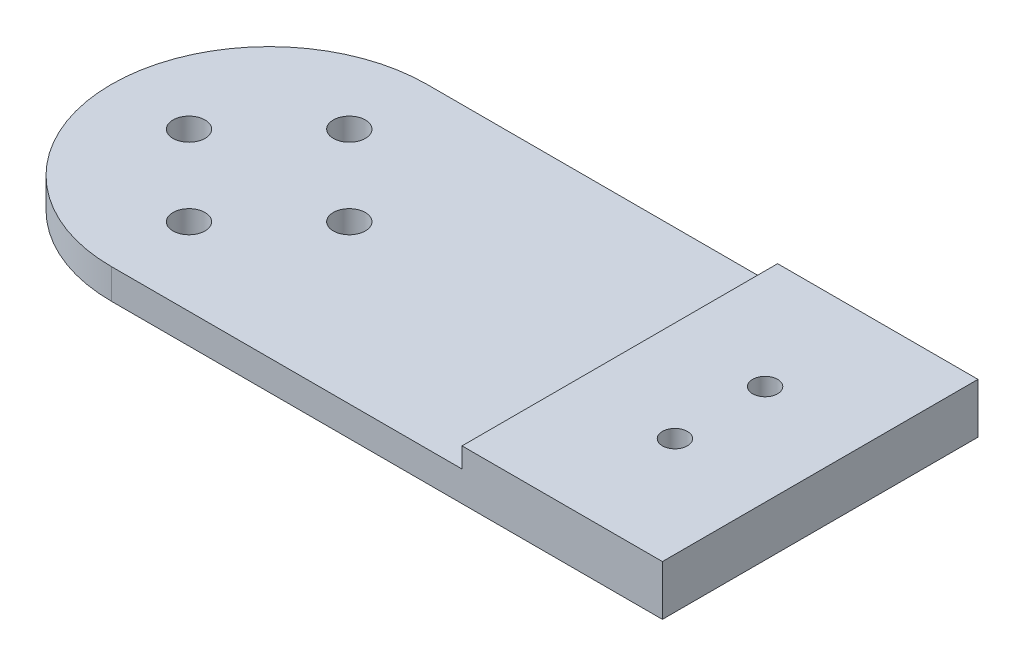
ISO-10303-21;
HEADER;
FILE_DESCRIPTION(('STEP AP214'),'2;1');
FILE_NAME('part.step','',(''),(''),'','','');
FILE_SCHEMA(('AUTOMOTIVE_DESIGN { 1 0 10303 214 1 1 1 1 }'));
ENDSEC;
DATA;
#1=APPLICATION_CONTEXT('core data for automotive mechanical design processes');
#2=APPLICATION_PROTOCOL_DEFINITION('international standard','automotive_design',2000,#1);
#3=PRODUCT_CONTEXT('',#1,'mechanical');
#4=PRODUCT('Part','Part','',(#3));
#5=PRODUCT_RELATED_PRODUCT_CATEGORY('part','',(#4));
#6=PRODUCT_DEFINITION_FORMATION('','',#4);
#7=PRODUCT_DEFINITION_CONTEXT('part definition',#1,'design');
#8=PRODUCT_DEFINITION('design','',#6,#7);
#9=PRODUCT_DEFINITION_SHAPE('','',#8);
#10=(LENGTH_UNIT() NAMED_UNIT(*) SI_UNIT(.MILLI.,.METRE.));
#11=(NAMED_UNIT(*) PLANE_ANGLE_UNIT() SI_UNIT($,.RADIAN.));
#12=(NAMED_UNIT(*) SI_UNIT($,.STERADIAN.) SOLID_ANGLE_UNIT());
#13=UNCERTAINTY_MEASURE_WITH_UNIT(LENGTH_MEASURE(1.E-05),#10,'distance_accuracy_value','');
#14=(GEOMETRIC_REPRESENTATION_CONTEXT(3) GLOBAL_UNCERTAINTY_ASSIGNED_CONTEXT((#13)) GLOBAL_UNIT_ASSIGNED_CONTEXT((#10,
#11,#12)) REPRESENTATION_CONTEXT('',''));
#15=CARTESIAN_POINT('',(0.,0.,0.));
#16=DIRECTION('',(0.,0.,1.));
#17=DIRECTION('',(1.,0.,0.));
#18=AXIS2_PLACEMENT_3D('',#15,#16,#17);
#19=CARTESIAN_POINT('',(0.,3.,0.));
#20=DIRECTION('',(0.,-1.,0.));
#21=DIRECTION('',(0.,0.,-1.));
#22=AXIS2_PLACEMENT_3D('',#19,#20,#21);
#23=CYLINDRICAL_SURFACE('',#22,15.75);
#24=DIRECTION('',(0.,-1.,0.));
#25=VECTOR('',#24,1.);
#26=CARTESIAN_POINT('',(0.,3.,15.75));
#27=LINE('',#26,#25);
#28=CARTESIAN_POINT('',(0.,3.,15.75));
#29=VERTEX_POINT('',#28);
#30=CARTESIAN_POINT('',(0.,0.,15.75));
#31=VERTEX_POINT('',#30);
#32=EDGE_CURVE('E98',#29,#31,#27,.T.);
#33=ORIENTED_EDGE('',*,*,#32,.F.);
#34=CARTESIAN_POINT('',(0.,3.,0.));
#35=DIRECTION('',(0.,1.,0.));
#36=DIRECTION('',(0.,0.,1.));
#37=AXIS2_PLACEMENT_3D('',#34,#35,#36);
#38=CIRCLE('',#37,15.75);
#39=CARTESIAN_POINT('',(0.,3.,-15.75));
#40=VERTEX_POINT('',#39);
#41=EDGE_CURVE('E11',#40,#29,#38,.T.);
#42=ORIENTED_EDGE('',*,*,#41,.F.);
#43=DIRECTION('',(0.,-1.,0.));
#44=VECTOR('',#43,1.);
#45=CARTESIAN_POINT('',(0.,3.,-15.75));
#46=LINE('',#45,#44);
#47=CARTESIAN_POINT('',(0.,0.,-15.75));
#48=VERTEX_POINT('',#47);
#49=EDGE_CURVE('E144',#40,#48,#46,.T.);
#50=ORIENTED_EDGE('',*,*,#49,.T.);
#51=CARTESIAN_POINT('',(0.,0.,0.));
#52=DIRECTION('',(0.,1.,0.));
#53=DIRECTION('',(0.,0.,1.));
#54=AXIS2_PLACEMENT_3D('',#51,#52,#53);
#55=CIRCLE('',#54,15.75);
#56=EDGE_CURVE('E41',#48,#31,#55,.T.);
#57=ORIENTED_EDGE('',*,*,#56,.T.);
#58=EDGE_LOOP('',(#33,#42,#50,#57));
#59=FACE_BOUND('',#58,.T.);
#60=ADVANCED_FACE('F38',(#59),#23,.T.);
#61=CARTESIAN_POINT('',(0.,3.,0.));
#62=DIRECTION('',(0.,1.,0.));
#63=DIRECTION('',(0.,0.,1.));
#64=AXIS2_PLACEMENT_3D('',#61,#62,#63);
#65=PLANE('',#64);
#66=DIRECTION('',(0.,0.,1.));
#67=VECTOR('',#66,1.);
#68=CARTESIAN_POINT('',(35.,3.,0.));
#69=LINE('',#68,#67);
#70=CARTESIAN_POINT('',(35.,3.,-15.75));
#71=VERTEX_POINT('',#70);
#72=CARTESIAN_POINT('',(35.,3.,15.75));
#73=VERTEX_POINT('',#72);
#74=EDGE_CURVE('E131',#71,#73,#69,.T.);
#75=ORIENTED_EDGE('',*,*,#74,.F.);
#76=DIRECTION('',(1.,0.,0.));
#77=VECTOR('',#76,1.);
#78=CARTESIAN_POINT('',(0.,3.,-15.75));
#79=LINE('',#78,#77);
#80=EDGE_CURVE('E137',#40,#71,#79,.T.);
#81=ORIENTED_EDGE('',*,*,#80,.F.);
#82=ORIENTED_EDGE('',*,*,#41,.T.);
#83=DIRECTION('',(-1.,0.,0.));
#84=VECTOR('',#83,1.);
#85=CARTESIAN_POINT('',(0.,3.,15.75));
#86=LINE('',#85,#84);
#87=EDGE_CURVE('E141',#73,#29,#86,.T.);
#88=ORIENTED_EDGE('',*,*,#87,.F.);
#89=EDGE_LOOP('',(#75,#81,#82,#88));
#90=FACE_BOUND('',#89,.T.);
#91=CARTESIAN_POINT('',(0.,3.,8.));
#92=DIRECTION('',(0.,1.,0.));
#93=DIRECTION('',(0.,0.,-1.));
#94=AXIS2_PLACEMENT_3D('',#91,#92,#93);
#95=CIRCLE('',#94,1.6);
#96=CARTESIAN_POINT('',(0.,3.,6.4));
#97=VERTEX_POINT('',#96);
#98=EDGE_CURVE('E168',#97,#97,#95,.T.);
#99=ORIENTED_EDGE('',*,*,#98,.F.);
#100=EDGE_LOOP('',(#99));
#101=FACE_BOUND('',#100,.T.);
#102=CARTESIAN_POINT('',(0.,3.,-8.));
#103=DIRECTION('',(0.,1.,0.));
#104=DIRECTION('',(0.,0.,1.));
#105=AXIS2_PLACEMENT_3D('',#102,#103,#104);
#106=CIRCLE('',#105,1.6);
#107=CARTESIAN_POINT('',(0.,3.,-6.4));
#108=VERTEX_POINT('',#107);
#109=EDGE_CURVE('E184',#108,#108,#106,.T.);
#110=ORIENTED_EDGE('',*,*,#109,.F.);
#111=EDGE_LOOP('',(#110));
#112=FACE_BOUND('',#111,.T.);
#113=CARTESIAN_POINT('',(8.,3.,0.));
#114=DIRECTION('',(0.,1.,0.));
#115=DIRECTION('',(0.,0.,1.));
#116=AXIS2_PLACEMENT_3D('',#113,#114,#115);
#117=CIRCLE('',#116,1.6);
#118=CARTESIAN_POINT('',(8.,3.,1.6));
#119=VERTEX_POINT('',#118);
#120=EDGE_CURVE('E176',#119,#119,#117,.T.);
#121=ORIENTED_EDGE('',*,*,#120,.F.);
#122=EDGE_LOOP('',(#121));
#123=FACE_BOUND('',#122,.T.);
#124=CARTESIAN_POINT('',(-8.,3.,0.));
#125=DIRECTION('',(0.,1.,0.));
#126=DIRECTION('',(0.,0.,-1.));
#127=AXIS2_PLACEMENT_3D('',#124,#125,#126);
#128=CIRCLE('',#127,1.6);
#129=CARTESIAN_POINT('',(-8.,3.,-1.6));
#130=VERTEX_POINT('',#129);
#131=EDGE_CURVE('E160',#130,#130,#128,.T.);
#132=ORIENTED_EDGE('',*,*,#131,.F.);
#133=EDGE_LOOP('',(#132));
#134=FACE_BOUND('',#133,.T.);
#135=ADVANCED_FACE('F208',(#90,#101,#112,#123,#134),#65,.T.);
#136=CARTESIAN_POINT('',(0.,0.,0.));
#137=DIRECTION('',(0.,1.,0.));
#138=DIRECTION('',(0.,0.,1.));
#139=AXIS2_PLACEMENT_3D('',#136,#137,#138);
#140=PLANE('',#139);
#141=CARTESIAN_POINT('',(45.0000000000005,0.,-4.5000000000004));
#142=DIRECTION('',(0.,1.,0.));
#143=DIRECTION('',(0.,0.,1.));
#144=AXIS2_PLACEMENT_3D('',#141,#142,#143);
#145=CIRCLE('',#144,1.2500000000022);
#146=CARTESIAN_POINT('',(45.0000000000005,0.,-3.24999999999819));
#147=VERTEX_POINT('',#146);
#148=EDGE_CURVE('E115',#147,#147,#145,.T.);
#149=ORIENTED_EDGE('',*,*,#148,.T.);
#150=EDGE_LOOP('',(#149));
#151=FACE_BOUND('',#150,.T.);
#152=CARTESIAN_POINT('',(45.0000000000005,0.,4.4999999999996));
#153=DIRECTION('',(0.,1.,0.));
#154=DIRECTION('',(0.,0.,1.));
#155=AXIS2_PLACEMENT_3D('',#152,#153,#154);
#156=CIRCLE('',#155,1.25000000000178);
#157=CARTESIAN_POINT('',(45.0000000000005,0.,5.75000000000138));
#158=VERTEX_POINT('',#157);
#159=EDGE_CURVE('E119',#158,#158,#156,.T.);
#160=ORIENTED_EDGE('',*,*,#159,.T.);
#161=EDGE_LOOP('',(#160));
#162=FACE_BOUND('',#161,.T.);
#163=DIRECTION('',(1.,0.,0.));
#164=VECTOR('',#163,1.);
#165=CARTESIAN_POINT('',(0.,0.,-15.75));
#166=LINE('',#165,#164);
#167=CARTESIAN_POINT('',(55.,0.,-15.75));
#168=VERTEX_POINT('',#167);
#169=EDGE_CURVE('E136',#48,#168,#166,.T.);
#170=ORIENTED_EDGE('',*,*,#169,.T.);
#171=DIRECTION('',(0.,0.,1.));
#172=VECTOR('',#171,1.);
#173=CARTESIAN_POINT('',(55.,0.,15.75));
#174=LINE('',#173,#172);
#175=CARTESIAN_POINT('',(55.,0.,15.75));
#176=VERTEX_POINT('',#175);
#177=EDGE_CURVE('E147',#168,#176,#174,.T.);
#178=ORIENTED_EDGE('',*,*,#177,.T.);
#179=DIRECTION('',(-1.,0.,0.));
#180=VECTOR('',#179,1.);
#181=CARTESIAN_POINT('',(0.,0.,15.75));
#182=LINE('',#181,#180);
#183=EDGE_CURVE('E61',#176,#31,#182,.T.);
#184=ORIENTED_EDGE('',*,*,#183,.T.);
#185=ORIENTED_EDGE('',*,*,#56,.F.);
#186=EDGE_LOOP('',(#170,#178,#184,#185));
#187=FACE_BOUND('',#186,.T.);
#188=CARTESIAN_POINT('',(0.,0.,-8.));
#189=DIRECTION('',(0.,1.,0.));
#190=DIRECTION('',(0.,0.,1.));
#191=AXIS2_PLACEMENT_3D('',#188,#189,#190);
#192=CIRCLE('',#191,1.6);
#193=CARTESIAN_POINT('',(0.,0.,-6.4));
#194=VERTEX_POINT('',#193);
#195=EDGE_CURVE('E180',#194,#194,#192,.T.);
#196=ORIENTED_EDGE('',*,*,#195,.T.);
#197=EDGE_LOOP('',(#196));
#198=FACE_BOUND('',#197,.T.);
#199=CARTESIAN_POINT('',(8.,0.,0.));
#200=DIRECTION('',(0.,1.,0.));
#201=DIRECTION('',(0.,0.,1.));
#202=AXIS2_PLACEMENT_3D('',#199,#200,#201);
#203=CIRCLE('',#202,1.6);
#204=CARTESIAN_POINT('',(8.,0.,1.6));
#205=VERTEX_POINT('',#204);
#206=EDGE_CURVE('E172',#205,#205,#203,.T.);
#207=ORIENTED_EDGE('',*,*,#206,.T.);
#208=EDGE_LOOP('',(#207));
#209=FACE_BOUND('',#208,.T.);
#210=CARTESIAN_POINT('',(0.,0.,8.));
#211=DIRECTION('',(0.,1.,0.));
#212=DIRECTION('',(0.,0.,-1.));
#213=AXIS2_PLACEMENT_3D('',#210,#211,#212);
#214=CIRCLE('',#213,1.6);
#215=CARTESIAN_POINT('',(0.,0.,6.4));
#216=VERTEX_POINT('',#215);
#217=EDGE_CURVE('E164',#216,#216,#214,.T.);
#218=ORIENTED_EDGE('',*,*,#217,.T.);
#219=EDGE_LOOP('',(#218));
#220=FACE_BOUND('',#219,.T.);
#221=CARTESIAN_POINT('',(-8.,0.,0.));
#222=DIRECTION('',(0.,1.,0.));
#223=DIRECTION('',(0.,0.,-1.));
#224=AXIS2_PLACEMENT_3D('',#221,#222,#223);
#225=CIRCLE('',#224,1.6);
#226=CARTESIAN_POINT('',(-8.,0.,-1.6));
#227=VERTEX_POINT('',#226);
#228=EDGE_CURVE('E153',#227,#227,#225,.T.);
#229=ORIENTED_EDGE('',*,*,#228,.T.);
#230=EDGE_LOOP('',(#229));
#231=FACE_BOUND('',#230,.T.);
#232=ADVANCED_FACE('F192',(#151,#162,#187,#198,#209,#220,#231),#140,.F.);
#233=CARTESIAN_POINT('',(0.,3.,-8.));
#234=DIRECTION('',(0.,-1.,0.));
#235=DIRECTION('',(0.,0.,-1.));
#236=AXIS2_PLACEMENT_3D('',#233,#234,#235);
#237=CYLINDRICAL_SURFACE('',#236,1.6);
#238=ORIENTED_EDGE('',*,*,#109,.T.);
#239=EDGE_LOOP('',(#238));
#240=FACE_BOUND('',#239,.T.);
#241=ORIENTED_EDGE('',*,*,#195,.F.);
#242=EDGE_LOOP('',(#241));
#243=FACE_BOUND('',#242,.T.);
#244=ADVANCED_FACE('F195',(#240,#243),#237,.F.);
#245=CARTESIAN_POINT('',(8.,3.,0.));
#246=DIRECTION('',(0.,-1.,0.));
#247=DIRECTION('',(0.,0.,-1.));
#248=AXIS2_PLACEMENT_3D('',#245,#246,#247);
#249=CYLINDRICAL_SURFACE('',#248,1.6);
#250=ORIENTED_EDGE('',*,*,#120,.T.);
#251=EDGE_LOOP('',(#250));
#252=FACE_BOUND('',#251,.T.);
#253=ORIENTED_EDGE('',*,*,#206,.F.);
#254=EDGE_LOOP('',(#253));
#255=FACE_BOUND('',#254,.T.);
#256=ADVANCED_FACE('F197',(#252,#255),#249,.F.);
#257=CARTESIAN_POINT('',(0.,3.,8.));
#258=DIRECTION('',(0.,-1.,0.));
#259=DIRECTION('',(0.,0.,-1.));
#260=AXIS2_PLACEMENT_3D('',#257,#258,#259);
#261=CYLINDRICAL_SURFACE('',#260,1.6);
#262=ORIENTED_EDGE('',*,*,#98,.T.);
#263=EDGE_LOOP('',(#262));
#264=FACE_BOUND('',#263,.T.);
#265=ORIENTED_EDGE('',*,*,#217,.F.);
#266=EDGE_LOOP('',(#265));
#267=FACE_BOUND('',#266,.T.);
#268=ADVANCED_FACE('F204',(#264,#267),#261,.F.);
#269=CARTESIAN_POINT('',(-8.,3.,0.));
#270=DIRECTION('',(0.,-1.,0.));
#271=DIRECTION('',(0.,0.,-1.));
#272=AXIS2_PLACEMENT_3D('',#269,#270,#271);
#273=CYLINDRICAL_SURFACE('',#272,1.6);
#274=ORIENTED_EDGE('',*,*,#131,.T.);
#275=EDGE_LOOP('',(#274));
#276=FACE_BOUND('',#275,.T.);
#277=ORIENTED_EDGE('',*,*,#228,.F.);
#278=EDGE_LOOP('',(#277));
#279=FACE_BOUND('',#278,.T.);
#280=ADVANCED_FACE('F244',(#276,#279),#273,.F.);
#281=CARTESIAN_POINT('',(0.,3.,15.75));
#282=DIRECTION('',(0.,0.,1.));
#283=DIRECTION('',(1.,0.,0.));
#284=AXIS2_PLACEMENT_3D('',#281,#282,#283);
#285=PLANE('',#284);
#286=ORIENTED_EDGE('',*,*,#32,.T.);
#287=ORIENTED_EDGE('',*,*,#183,.F.);
#288=DIRECTION('',(0.,-1.,0.));
#289=VECTOR('',#288,1.);
#290=CARTESIAN_POINT('',(55.,3.,15.75));
#291=LINE('',#290,#289);
#292=CARTESIAN_POINT('',(55.,5.,15.75));
#293=VERTEX_POINT('',#292);
#294=EDGE_CURVE('E89',#293,#176,#291,.T.);
#295=ORIENTED_EDGE('',*,*,#294,.F.);
#296=DIRECTION('',(-1.,0.,0.));
#297=VECTOR('',#296,1.);
#298=CARTESIAN_POINT('',(55.,5.,15.75));
#299=LINE('',#298,#297);
#300=CARTESIAN_POINT('',(35.,5.,15.75));
#301=VERTEX_POINT('',#300);
#302=EDGE_CURVE('E93',#293,#301,#299,.T.);
#303=ORIENTED_EDGE('',*,*,#302,.T.);
#304=DIRECTION('',(0.,-1.,0.));
#305=VECTOR('',#304,1.);
#306=CARTESIAN_POINT('',(35.,5.,15.75));
#307=LINE('',#306,#305);
#308=EDGE_CURVE('E53',#301,#73,#307,.T.);
#309=ORIENTED_EDGE('',*,*,#308,.T.);
#310=ORIENTED_EDGE('',*,*,#87,.T.);
#311=EDGE_LOOP('',(#286,#287,#295,#303,#309,#310));
#312=FACE_BOUND('',#311,.T.);
#313=ADVANCED_FACE('F92',(#312),#285,.T.);
#314=CARTESIAN_POINT('',(55.,3.,15.75));
#315=DIRECTION('',(1.,0.,0.));
#316=DIRECTION('',(0.,0.,-1.));
#317=AXIS2_PLACEMENT_3D('',#314,#315,#316);
#318=PLANE('',#317);
#319=ORIENTED_EDGE('',*,*,#177,.F.);
#320=DIRECTION('',(0.,-1.,0.));
#321=VECTOR('',#320,1.);
#322=CARTESIAN_POINT('',(55.,3.,-15.75));
#323=LINE('',#322,#321);
#324=CARTESIAN_POINT('',(55.,5.,-15.75));
#325=VERTEX_POINT('',#324);
#326=EDGE_CURVE('E99',#325,#168,#323,.T.);
#327=ORIENTED_EDGE('',*,*,#326,.F.);
#328=DIRECTION('',(0.,0.,1.));
#329=VECTOR('',#328,1.);
#330=CARTESIAN_POINT('',(55.,5.,15.75));
#331=LINE('',#330,#329);
#332=EDGE_CURVE('E106',#325,#293,#331,.T.);
#333=ORIENTED_EDGE('',*,*,#332,.T.);
#334=ORIENTED_EDGE('',*,*,#294,.T.);
#335=EDGE_LOOP('',(#319,#327,#333,#334));
#336=FACE_BOUND('',#335,.T.);
#337=ADVANCED_FACE('F112',(#336),#318,.T.);
#338=CARTESIAN_POINT('',(0.,3.,-15.75));
#339=DIRECTION('',(0.,0.,-1.));
#340=DIRECTION('',(-1.,0.,0.));
#341=AXIS2_PLACEMENT_3D('',#338,#339,#340);
#342=PLANE('',#341);
#343=ORIENTED_EDGE('',*,*,#80,.T.);
#344=DIRECTION('',(0.,-1.,0.));
#345=VECTOR('',#344,1.);
#346=CARTESIAN_POINT('',(35.,5.,-15.75));
#347=LINE('',#346,#345);
#348=CARTESIAN_POINT('',(35.,5.,-15.75));
#349=VERTEX_POINT('',#348);
#350=EDGE_CURVE('E128',#349,#71,#347,.T.);
#351=ORIENTED_EDGE('',*,*,#350,.F.);
#352=DIRECTION('',(1.,0.,0.));
#353=VECTOR('',#352,1.);
#354=CARTESIAN_POINT('',(55.,5.,-15.75));
#355=LINE('',#354,#353);
#356=EDGE_CURVE('E125',#349,#325,#355,.T.);
#357=ORIENTED_EDGE('',*,*,#356,.T.);
#358=ORIENTED_EDGE('',*,*,#326,.T.);
#359=ORIENTED_EDGE('',*,*,#169,.F.);
#360=ORIENTED_EDGE('',*,*,#49,.F.);
#361=EDGE_LOOP('',(#343,#351,#357,#358,#359,#360));
#362=FACE_BOUND('',#361,.T.);
#363=ADVANCED_FACE('F224',(#362),#342,.T.);
#364=CARTESIAN_POINT('',(35.,5.,15.75));
#365=DIRECTION('',(-1.,0.,0.));
#366=DIRECTION('',(0.,0.,1.));
#367=AXIS2_PLACEMENT_3D('',#364,#365,#366);
#368=PLANE('',#367);
#369=ORIENTED_EDGE('',*,*,#350,.T.);
#370=ORIENTED_EDGE('',*,*,#74,.T.);
#371=ORIENTED_EDGE('',*,*,#308,.F.);
#372=DIRECTION('',(0.,0.,-1.));
#373=VECTOR('',#372,1.);
#374=CARTESIAN_POINT('',(35.,5.,15.75));
#375=LINE('',#374,#373);
#376=EDGE_CURVE('E109',#301,#349,#375,.T.);
#377=ORIENTED_EDGE('',*,*,#376,.T.);
#378=EDGE_LOOP('',(#369,#370,#371,#377));
#379=FACE_BOUND('',#378,.T.);
#380=ADVANCED_FACE('F228',(#379),#368,.T.);
#381=CARTESIAN_POINT('',(0.,5.,0.));
#382=DIRECTION('',(0.,1.,0.));
#383=DIRECTION('',(0.,0.,1.));
#384=AXIS2_PLACEMENT_3D('',#381,#382,#383);
#385=PLANE('',#384);
#386=CARTESIAN_POINT('',(45.0000000000005,5.,-4.5000000000004));
#387=DIRECTION('',(0.,1.,0.));
#388=DIRECTION('',(0.,0.,1.));
#389=AXIS2_PLACEMENT_3D('',#386,#387,#388);
#390=CIRCLE('',#389,1.2500000000022);
#391=CARTESIAN_POINT('',(45.0000000000005,5.,-3.24999999999819));
#392=VERTEX_POINT('',#391);
#393=EDGE_CURVE('E324',#392,#392,#390,.T.);
#394=ORIENTED_EDGE('',*,*,#393,.F.);
#395=EDGE_LOOP('',(#394));
#396=FACE_BOUND('',#395,.T.);
#397=CARTESIAN_POINT('',(45.0000000000005,5.,4.4999999999996));
#398=DIRECTION('',(0.,1.,0.));
#399=DIRECTION('',(0.,0.,1.));
#400=AXIS2_PLACEMENT_3D('',#397,#398,#399);
#401=CIRCLE('',#400,1.25000000000178);
#402=CARTESIAN_POINT('',(45.0000000000005,5.,5.75000000000138));
#403=VERTEX_POINT('',#402);
#404=EDGE_CURVE('E332',#403,#403,#401,.T.);
#405=ORIENTED_EDGE('',*,*,#404,.F.);
#406=EDGE_LOOP('',(#405));
#407=FACE_BOUND('',#406,.T.);
#408=ORIENTED_EDGE('',*,*,#332,.F.);
#409=ORIENTED_EDGE('',*,*,#356,.F.);
#410=ORIENTED_EDGE('',*,*,#376,.F.);
#411=ORIENTED_EDGE('',*,*,#302,.F.);
#412=EDGE_LOOP('',(#408,#409,#410,#411));
#413=FACE_BOUND('',#412,.T.);
#414=ADVANCED_FACE('F104',(#396,#407,#413),#385,.T.);
#415=CARTESIAN_POINT('',(45.0000000000005,-5.,4.4999999999996));
#416=DIRECTION('',(0.,1.,0.));
#417=DIRECTION('',(0.,0.,1.));
#418=AXIS2_PLACEMENT_3D('',#415,#416,#417);
#419=CYLINDRICAL_SURFACE('',#418,1.25000000000178);
#420=ORIENTED_EDGE('',*,*,#404,.T.);
#421=EDGE_LOOP('',(#420));
#422=FACE_BOUND('',#421,.T.);
#423=ORIENTED_EDGE('',*,*,#159,.F.);
#424=EDGE_LOOP('',(#423));
#425=FACE_BOUND('',#424,.T.);
#426=ADVANCED_FACE('F236',(#422,#425),#419,.F.);
#427=CARTESIAN_POINT('',(45.0000000000005,-5.,-4.5000000000004));
#428=DIRECTION('',(0.,1.,0.));
#429=DIRECTION('',(0.,0.,1.));
#430=AXIS2_PLACEMENT_3D('',#427,#428,#429);
#431=CYLINDRICAL_SURFACE('',#430,1.2500000000022);
#432=ORIENTED_EDGE('',*,*,#393,.T.);
#433=EDGE_LOOP('',(#432));
#434=FACE_BOUND('',#433,.T.);
#435=ORIENTED_EDGE('',*,*,#148,.F.);
#436=EDGE_LOOP('',(#435));
#437=FACE_BOUND('',#436,.T.);
#438=ADVANCED_FACE('F308',(#434,#437),#431,.F.);
#439=CLOSED_SHELL('',(#60,#135,#232,#244,#256,#268,#280,#313,#337,#363,#380,#414,#426,#438));
#440=MANIFOLD_SOLID_BREP('B2',#439);
#441=ADVANCED_BREP_SHAPE_REPRESENTATION('',(#18,#440),#14);
#442=SHAPE_DEFINITION_REPRESENTATION(#9,#441);
ENDSEC;
END-ISO-10303-21;
